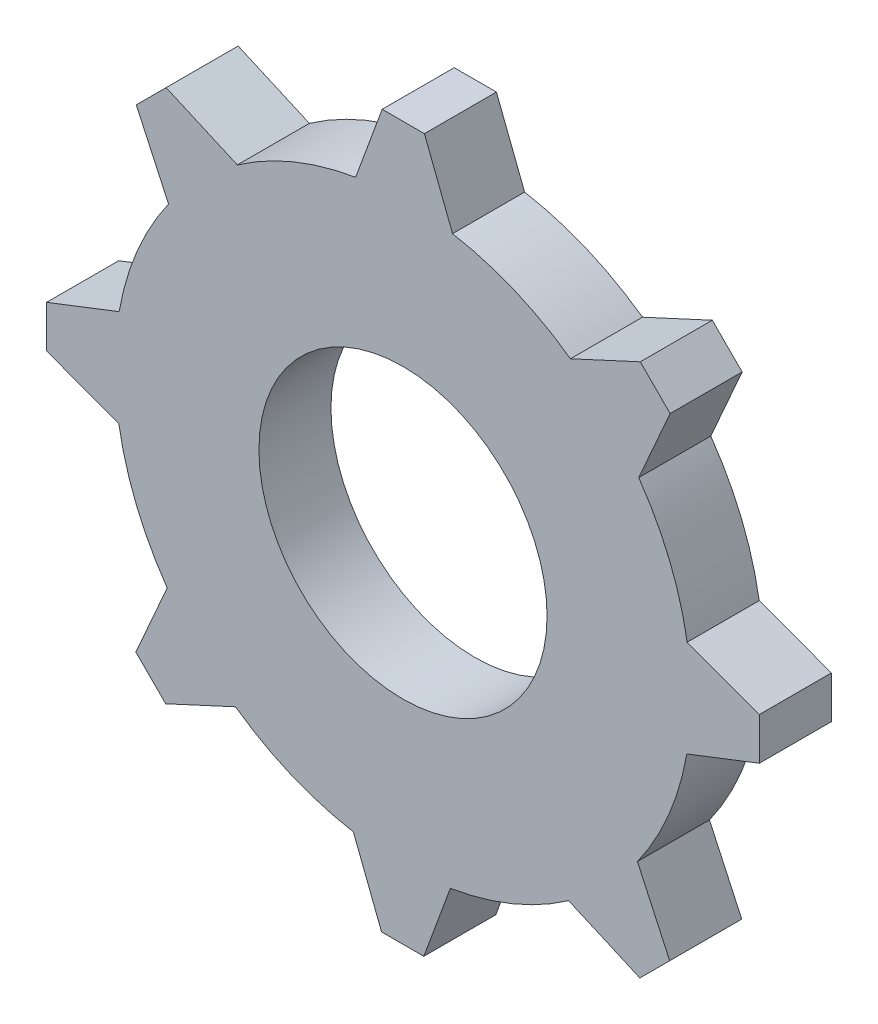
ISO-10303-21;
HEADER;
FILE_DESCRIPTION(('STEP AP214'),'2;1');
FILE_NAME('part.step','',(''),(''),'','','');
FILE_SCHEMA(('AUTOMOTIVE_DESIGN { 1 0 10303 214 1 1 1 1 }'));
ENDSEC;
DATA;
#1=APPLICATION_CONTEXT('core data for automotive mechanical design processes');
#2=APPLICATION_PROTOCOL_DEFINITION('international standard','automotive_design',2000,#1);
#3=PRODUCT_CONTEXT('',#1,'mechanical');
#4=PRODUCT('Part','Part','',(#3));
#5=PRODUCT_RELATED_PRODUCT_CATEGORY('part','',(#4));
#6=PRODUCT_DEFINITION_FORMATION('','',#4);
#7=PRODUCT_DEFINITION_CONTEXT('part definition',#1,'design');
#8=PRODUCT_DEFINITION('design','',#6,#7);
#9=PRODUCT_DEFINITION_SHAPE('','',#8);
#10=(LENGTH_UNIT() NAMED_UNIT(*) SI_UNIT(.MILLI.,.METRE.));
#11=(NAMED_UNIT(*) PLANE_ANGLE_UNIT() SI_UNIT($,.RADIAN.));
#12=(NAMED_UNIT(*) SI_UNIT($,.STERADIAN.) SOLID_ANGLE_UNIT());
#13=UNCERTAINTY_MEASURE_WITH_UNIT(LENGTH_MEASURE(1.E-05),#10,'distance_accuracy_value','');
#14=(GEOMETRIC_REPRESENTATION_CONTEXT(3) GLOBAL_UNCERTAINTY_ASSIGNED_CONTEXT((#13)) GLOBAL_UNIT_ASSIGNED_CONTEXT((#10,
#11,#12)) REPRESENTATION_CONTEXT('',''));
#15=CARTESIAN_POINT('',(0.,0.,0.));
#16=DIRECTION('',(0.,0.,1.));
#17=DIRECTION('',(1.,0.,0.));
#18=AXIS2_PLACEMENT_3D('',#15,#16,#17);
#19=CARTESIAN_POINT('',(0.,0.,2.));
#20=DIRECTION('',(0.,0.,-1.));
#21=DIRECTION('',(-1.,0.,0.));
#22=AXIS2_PLACEMENT_3D('',#19,#20,#21);
#23=CYLINDRICAL_SURFACE('',#22,8.);
#24=DIRECTION('',(0.,0.,-1.));
#25=VECTOR('',#24,1.);
#26=CARTESIAN_POINT('',(-6.50960676883214,4.65027092922281,2.));
#27=LINE('',#26,#25);
#28=CARTESIAN_POINT('',(-6.50960676883214,4.65027092922281,2.));
#29=VERTEX_POINT('',#28);
#30=CARTESIAN_POINT('',(-6.50960676883214,4.65027092922281,0.));
#31=VERTEX_POINT('',#30);
#32=EDGE_CURVE('E264',#29,#31,#27,.T.);
#33=ORIENTED_EDGE('',*,*,#32,.T.);
#34=CARTESIAN_POINT('',(0.,0.,0.));
#35=DIRECTION('',(0.,0.,1.));
#36=DIRECTION('',(1.,0.,0.));
#37=AXIS2_PLACEMENT_3D('',#34,#35,#36);
#38=CIRCLE('',#37,8.);
#39=CARTESIAN_POINT('',(-7.88063511388804,1.37680434403542,0.));
#40=VERTEX_POINT('',#39);
#41=EDGE_CURVE('E517',#31,#40,#38,.T.);
#42=ORIENTED_EDGE('',*,*,#41,.T.);
#43=DIRECTION('',(0.,0.,-1.));
#44=VECTOR('',#43,1.);
#45=CARTESIAN_POINT('',(-7.88063511388804,1.37680434403542,2.));
#46=LINE('',#45,#44);
#47=CARTESIAN_POINT('',(-7.88063511388804,1.37680434403542,2.));
#48=VERTEX_POINT('',#47);
#49=EDGE_CURVE('E296',#48,#40,#46,.T.);
#50=ORIENTED_EDGE('',*,*,#49,.F.);
#51=CARTESIAN_POINT('',(0.,0.,2.));
#52=DIRECTION('',(0.,0.,1.));
#53=DIRECTION('',(1.,0.,0.));
#54=AXIS2_PLACEMENT_3D('',#51,#52,#53);
#55=CIRCLE('',#54,8.);
#56=EDGE_CURVE('E42',#29,#48,#55,.T.);
#57=ORIENTED_EDGE('',*,*,#56,.F.);
#58=EDGE_LOOP('',(#33,#42,#50,#57));
#59=FACE_BOUND('',#58,.T.);
#60=ADVANCED_FACE('F33',(#59),#23,.T.);
#61=DIRECTION('',(0.,0.,-1.));
#62=VECTOR('',#61,1.);
#63=CARTESIAN_POINT('',(-4.5989028410525,6.54599821712161,2.));
#64=LINE('',#63,#62);
#65=CARTESIAN_POINT('',(-4.5989028410525,6.54599821712161,2.));
#66=VERTEX_POINT('',#65);
#67=CARTESIAN_POINT('',(-4.5989028410525,6.54599821712161,0.));
#68=VERTEX_POINT('',#67);
#69=EDGE_CURVE('E57',#66,#68,#64,.T.);
#70=ORIENTED_EDGE('',*,*,#69,.F.);
#71=CARTESIAN_POINT('',(-1.31474898069104,7.89122519750716,2.));
#72=VERTEX_POINT('',#71);
#73=EDGE_CURVE('E11',#72,#66,#55,.T.);
#74=ORIENTED_EDGE('',*,*,#73,.F.);
#75=DIRECTION('',(0.,0.,-1.));
#76=VECTOR('',#75,1.);
#77=CARTESIAN_POINT('',(-1.31474898069104,7.89122519750716,2.));
#78=LINE('',#77,#76);
#79=CARTESIAN_POINT('',(-1.31474898069104,7.89122519750716,0.));
#80=VERTEX_POINT('',#79);
#81=EDGE_CURVE('E461',#72,#80,#78,.T.);
#82=ORIENTED_EDGE('',*,*,#81,.T.);
#83=EDGE_CURVE('E37',#80,#68,#38,.T.);
#84=ORIENTED_EDGE('',*,*,#83,.T.);
#85=EDGE_LOOP('',(#70,#74,#82,#84));
#86=FACE_BOUND('',#85,.T.);
#87=ADVANCED_FACE('F492',(#86),#23,.T.);
#88=DIRECTION('',(0.,0.,-1.));
#89=VECTOR('',#88,1.);
#90=CARTESIAN_POINT('',(-7.89122519750717,-1.31474898069095,2.));
#91=LINE('',#90,#89);
#92=CARTESIAN_POINT('',(-7.89122519750717,-1.31474898069095,2.));
#93=VERTEX_POINT('',#92);
#94=CARTESIAN_POINT('',(-7.89122519750717,-1.31474898069095,0.));
#95=VERTEX_POINT('',#94);
#96=EDGE_CURVE('E299',#93,#95,#91,.T.);
#97=ORIENTED_EDGE('',*,*,#96,.T.);
#98=CARTESIAN_POINT('',(-6.54599821712159,-4.59890284105252,0.));
#99=VERTEX_POINT('',#98);
#100=EDGE_CURVE('E519',#95,#99,#38,.T.);
#101=ORIENTED_EDGE('',*,*,#100,.T.);
#102=DIRECTION('',(0.,0.,-1.));
#103=VECTOR('',#102,1.);
#104=CARTESIAN_POINT('',(-6.54599821712159,-4.59890284105252,2.));
#105=LINE('',#104,#103);
#106=CARTESIAN_POINT('',(-6.54599821712159,-4.59890284105252,2.));
#107=VERTEX_POINT('',#106);
#108=EDGE_CURVE('E323',#107,#99,#105,.T.);
#109=ORIENTED_EDGE('',*,*,#108,.F.);
#110=EDGE_CURVE('E551',#93,#107,#55,.T.);
#111=ORIENTED_EDGE('',*,*,#110,.F.);
#112=EDGE_LOOP('',(#97,#101,#109,#111));
#113=FACE_BOUND('',#112,.T.);
#114=ADVANCED_FACE('F496',(#113),#23,.T.);
#115=DIRECTION('',(0.,0.,-1.));
#116=VECTOR('',#115,1.);
#117=CARTESIAN_POINT('',(-4.65027092922279,-6.50960676883216,2.));
#118=LINE('',#117,#116);
#119=CARTESIAN_POINT('',(-4.65027092922279,-6.50960676883216,2.));
#120=VERTEX_POINT('',#119);
#121=CARTESIAN_POINT('',(-4.65027092922279,-6.50960676883216,0.));
#122=VERTEX_POINT('',#121);
#123=EDGE_CURVE('E326',#120,#122,#118,.T.);
#124=ORIENTED_EDGE('',*,*,#123,.T.);
#125=CARTESIAN_POINT('',(-1.37680434403534,-7.88063511388806,0.));
#126=VERTEX_POINT('',#125);
#127=EDGE_CURVE('E520',#122,#126,#38,.T.);
#128=ORIENTED_EDGE('',*,*,#127,.T.);
#129=DIRECTION('',(0.,0.,-1.));
#130=VECTOR('',#129,1.);
#131=CARTESIAN_POINT('',(-1.37680434403534,-7.88063511388806,2.));
#132=LINE('',#131,#130);
#133=CARTESIAN_POINT('',(-1.37680434403534,-7.88063511388806,2.));
#134=VERTEX_POINT('',#133);
#135=EDGE_CURVE('E350',#134,#126,#132,.T.);
#136=ORIENTED_EDGE('',*,*,#135,.F.);
#137=EDGE_CURVE('E550',#120,#134,#55,.T.);
#138=ORIENTED_EDGE('',*,*,#137,.F.);
#139=EDGE_LOOP('',(#124,#128,#136,#138));
#140=FACE_BOUND('',#139,.T.);
#141=ADVANCED_FACE('F580',(#140),#23,.T.);
#142=DIRECTION('',(0.,0.,-1.));
#143=VECTOR('',#142,1.);
#144=CARTESIAN_POINT('',(1.31474898069104,-7.89122519750716,2.));
#145=LINE('',#144,#143);
#146=CARTESIAN_POINT('',(1.31474898069104,-7.89122519750716,2.));
#147=VERTEX_POINT('',#146);
#148=CARTESIAN_POINT('',(1.31474898069104,-7.89122519750716,0.));
#149=VERTEX_POINT('',#148);
#150=EDGE_CURVE('E353',#147,#149,#145,.T.);
#151=ORIENTED_EDGE('',*,*,#150,.T.);
#152=CARTESIAN_POINT('',(4.59890284105254,-6.54599821712157,0.));
#153=VERTEX_POINT('',#152);
#154=EDGE_CURVE('E523',#149,#153,#38,.T.);
#155=ORIENTED_EDGE('',*,*,#154,.T.);
#156=DIRECTION('',(0.,0.,-1.));
#157=VECTOR('',#156,1.);
#158=CARTESIAN_POINT('',(4.59890284105254,-6.54599821712157,2.));
#159=LINE('',#158,#157);
#160=CARTESIAN_POINT('',(4.59890284105254,-6.54599821712157,2.));
#161=VERTEX_POINT('',#160);
#162=EDGE_CURVE('E377',#161,#153,#159,.T.);
#163=ORIENTED_EDGE('',*,*,#162,.F.);
#164=EDGE_CURVE('E549',#147,#161,#55,.T.);
#165=ORIENTED_EDGE('',*,*,#164,.F.);
#166=EDGE_LOOP('',(#151,#155,#163,#165));
#167=FACE_BOUND('',#166,.T.);
#168=ADVANCED_FACE('F595',(#167),#23,.T.);
#169=DIRECTION('',(0.,0.,-1.));
#170=VECTOR('',#169,1.);
#171=CARTESIAN_POINT('',(6.50960676883217,-4.65027092922277,2.));
#172=LINE('',#171,#170);
#173=CARTESIAN_POINT('',(6.50960676883217,-4.65027092922277,2.));
#174=VERTEX_POINT('',#173);
#175=CARTESIAN_POINT('',(6.50960676883217,-4.65027092922277,0.));
#176=VERTEX_POINT('',#175);
#177=EDGE_CURVE('E380',#174,#176,#172,.T.);
#178=ORIENTED_EDGE('',*,*,#177,.T.);
#179=CARTESIAN_POINT('',(7.88063511388805,-1.37680434403537,0.));
#180=VERTEX_POINT('',#179);
#181=EDGE_CURVE('E516',#176,#180,#38,.T.);
#182=ORIENTED_EDGE('',*,*,#181,.T.);
#183=DIRECTION('',(0.,0.,-1.));
#184=VECTOR('',#183,1.);
#185=CARTESIAN_POINT('',(7.88063511388805,-1.37680434403537,2.));
#186=LINE('',#185,#184);
#187=CARTESIAN_POINT('',(7.88063511388805,-1.37680434403537,2.));
#188=VERTEX_POINT('',#187);
#189=EDGE_CURVE('E404',#188,#180,#186,.T.);
#190=ORIENTED_EDGE('',*,*,#189,.F.);
#191=EDGE_CURVE('E547',#174,#188,#55,.T.);
#192=ORIENTED_EDGE('',*,*,#191,.F.);
#193=EDGE_LOOP('',(#178,#182,#190,#192));
#194=FACE_BOUND('',#193,.T.);
#195=ADVANCED_FACE('F504',(#194),#23,.T.);
#196=DIRECTION('',(0.,0.,-1.));
#197=VECTOR('',#196,1.);
#198=CARTESIAN_POINT('',(7.89122519750716,1.31474898069101,2.));
#199=LINE('',#198,#197);
#200=CARTESIAN_POINT('',(7.89122519750716,1.31474898069101,2.));
#201=VERTEX_POINT('',#200);
#202=CARTESIAN_POINT('',(7.89122519750716,1.31474898069101,0.));
#203=VERTEX_POINT('',#202);
#204=EDGE_CURVE('E407',#201,#203,#199,.T.);
#205=ORIENTED_EDGE('',*,*,#204,.T.);
#206=CARTESIAN_POINT('',(6.54599821712156,4.59890284105257,0.));
#207=VERTEX_POINT('',#206);
#208=EDGE_CURVE('E515',#203,#207,#38,.T.);
#209=ORIENTED_EDGE('',*,*,#208,.T.);
#210=DIRECTION('',(0.,0.,-1.));
#211=VECTOR('',#210,1.);
#212=CARTESIAN_POINT('',(6.54599821712156,4.59890284105257,2.));
#213=LINE('',#212,#211);
#214=CARTESIAN_POINT('',(6.54599821712156,4.59890284105257,2.));
#215=VERTEX_POINT('',#214);
#216=EDGE_CURVE('E431',#215,#207,#213,.T.);
#217=ORIENTED_EDGE('',*,*,#216,.F.);
#218=EDGE_CURVE('E518',#201,#215,#55,.T.);
#219=ORIENTED_EDGE('',*,*,#218,.F.);
#220=EDGE_LOOP('',(#205,#209,#217,#219));
#221=FACE_BOUND('',#220,.T.);
#222=ADVANCED_FACE('F498',(#221),#23,.T.);
#223=DIRECTION('',(0.,0.,-1.));
#224=VECTOR('',#223,1.);
#225=CARTESIAN_POINT('',(4.65027092922274,6.50960676883219,2.));
#226=LINE('',#225,#224);
#227=CARTESIAN_POINT('',(4.65027092922274,6.50960676883219,2.));
#228=VERTEX_POINT('',#227);
#229=CARTESIAN_POINT('',(4.65027092922274,6.50960676883219,0.));
#230=VERTEX_POINT('',#229);
#231=EDGE_CURVE('E434',#228,#230,#226,.T.);
#232=ORIENTED_EDGE('',*,*,#231,.T.);
#233=CARTESIAN_POINT('',(1.37680434403534,7.88063511388806,0.));
#234=VERTEX_POINT('',#233);
#235=EDGE_CURVE('E471',#230,#234,#38,.T.);
#236=ORIENTED_EDGE('',*,*,#235,.T.);
#237=DIRECTION('',(0.,0.,-1.));
#238=VECTOR('',#237,1.);
#239=CARTESIAN_POINT('',(1.37680434403534,7.88063511388806,2.));
#240=LINE('',#239,#238);
#241=CARTESIAN_POINT('',(1.37680434403534,7.88063511388806,2.));
#242=VERTEX_POINT('',#241);
#243=EDGE_CURVE('E458',#242,#234,#240,.T.);
#244=ORIENTED_EDGE('',*,*,#243,.F.);
#245=EDGE_CURVE('E43',#228,#242,#55,.T.);
#246=ORIENTED_EDGE('',*,*,#245,.F.);
#247=EDGE_LOOP('',(#232,#236,#244,#246));
#248=FACE_BOUND('',#247,.T.);
#249=ADVANCED_FACE('F35',(#248),#23,.T.);
#250=CARTESIAN_POINT('',(0.,0.,2.));
#251=DIRECTION('',(0.,0.,1.));
#252=DIRECTION('',(1.,0.,0.));
#253=AXIS2_PLACEMENT_3D('',#250,#251,#252);
#254=PLANE('',#253);
#255=ORIENTED_EDGE('',*,*,#73,.T.);
#256=DIRECTION('',(-0.915173590162917,0.403059920940195,0.));
#257=VECTOR('',#256,1.);
#258=CARTESIAN_POINT('',(-4.5989028410525,6.54599821712161,2.));
#259=LINE('',#258,#257);
#260=CARTESIAN_POINT('',(-6.57611749842603,7.41680129978148,2.));
#261=VERTEX_POINT('',#260);
#262=EDGE_CURVE('E250',#66,#261,#259,.T.);
#263=ORIENTED_EDGE('',*,*,#262,.T.);
#264=DIRECTION('',(-0.707106781186556,-0.707106781186539,0.));
#265=VECTOR('',#264,1.);
#266=CARTESIAN_POINT('',(-6.57611749842603,7.41680129978148,2.));
#267=LINE('',#266,#265);
#268=CARTESIAN_POINT('',(-7.40505215147342,6.58786664673412,2.));
#269=VERTEX_POINT('',#268);
#270=EDGE_CURVE('E242',#261,#269,#267,.T.);
#271=ORIENTED_EDGE('',*,*,#270,.T.);
#272=DIRECTION('',(0.41951017289391,-0.907750634722181,0.));
#273=VECTOR('',#272,1.);
#274=CARTESIAN_POINT('',(-7.40505215147342,6.58786664673412,2.));
#275=LINE('',#274,#273);
#276=EDGE_CURVE('E247',#269,#29,#275,.T.);
#277=ORIENTED_EDGE('',*,*,#276,.T.);
#278=ORIENTED_EDGE('',*,*,#56,.T.);
#279=DIRECTION('',(-0.932131854888362,-0.362119048245713,0.));
#280=VECTOR('',#279,1.);
#281=CARTESIAN_POINT('',(-7.88063511388804,1.37680434403542,2.));
#282=LINE('',#281,#280);
#283=CARTESIAN_POINT('',(-9.89448777080525,0.594453216772104,2.));
#284=VERTEX_POINT('',#283);
#285=EDGE_CURVE('E285',#48,#284,#282,.T.);
#286=ORIENTED_EDGE('',*,*,#285,.T.);
#287=DIRECTION('',(0.,-1.,0.));
#288=VECTOR('',#287,1.);
#289=CARTESIAN_POINT('',(-9.89448777080525,0.594453216772104,2.));
#290=LINE('',#289,#288);
#291=CARTESIAN_POINT('',(-9.89448777080526,-0.577837411888529,2.));
#292=VERTEX_POINT('',#291);
#293=EDGE_CURVE('E279',#284,#292,#290,.T.);
#294=ORIENTED_EDGE('',*,*,#293,.T.);
#295=DIRECTION('',(0.938515117468472,-0.34523814140842,0.));
#296=VECTOR('',#295,1.);
#297=CARTESIAN_POINT('',(-9.89448777080526,-0.577837411888529,2.));
#298=LINE('',#297,#296);
#299=EDGE_CURVE('E281',#292,#93,#298,.T.);
#300=ORIENTED_EDGE('',*,*,#299,.T.);
#301=ORIENTED_EDGE('',*,*,#110,.T.);
#302=DIRECTION('',(-0.403059920940192,-0.915173590162919,0.));
#303=VECTOR('',#302,1.);
#304=CARTESIAN_POINT('',(-6.54599821712159,-4.59890284105252,2.));
#305=LINE('',#304,#303);
#306=CARTESIAN_POINT('',(-7.41680129978146,-6.57611749842606,2.));
#307=VERTEX_POINT('',#306);
#308=EDGE_CURVE('E312',#107,#307,#305,.T.);
#309=ORIENTED_EDGE('',*,*,#308,.T.);
#310=DIRECTION('',(0.707106781186541,-0.707106781186554,0.));
#311=VECTOR('',#310,1.);
#312=CARTESIAN_POINT('',(-7.41680129978146,-6.57611749842606,2.));
#313=LINE('',#312,#311);
#314=CARTESIAN_POINT('',(-6.58786664673409,-7.40505215147344,2.));
#315=VERTEX_POINT('',#314);
#316=EDGE_CURVE('E306',#307,#315,#313,.T.);
#317=ORIENTED_EDGE('',*,*,#316,.T.);
#318=DIRECTION('',(0.907750634722179,0.419510172893913,0.));
#319=VECTOR('',#318,1.);
#320=CARTESIAN_POINT('',(-6.58786664673409,-7.40505215147344,2.));
#321=LINE('',#320,#319);
#322=EDGE_CURVE('E308',#315,#120,#321,.T.);
#323=ORIENTED_EDGE('',*,*,#322,.T.);
#324=ORIENTED_EDGE('',*,*,#137,.T.);
#325=DIRECTION('',(0.362119048245722,-0.932131854888358,0.));
#326=VECTOR('',#325,1.);
#327=CARTESIAN_POINT('',(-1.37680434403534,-7.88063511388806,2.));
#328=LINE('',#327,#326);
#329=CARTESIAN_POINT('',(-0.594453216772001,-9.89448777080526,2.));
#330=VERTEX_POINT('',#329);
#331=EDGE_CURVE('E339',#134,#330,#328,.T.);
#332=ORIENTED_EDGE('',*,*,#331,.T.);
#333=DIRECTION('',(1.,0.,0.));
#334=VECTOR('',#333,1.);
#335=CARTESIAN_POINT('',(-0.594453216772001,-9.89448777080526,2.));
#336=LINE('',#335,#334);
#337=CARTESIAN_POINT('',(0.577837411888633,-9.89448777080526,2.));
#338=VERTEX_POINT('',#337);
#339=EDGE_CURVE('E333',#330,#338,#336,.T.);
#340=ORIENTED_EDGE('',*,*,#339,.T.);
#341=DIRECTION('',(0.345238141408411,0.938515117468475,0.));
#342=VECTOR('',#341,1.);
#343=CARTESIAN_POINT('',(0.577837411888633,-9.89448777080526,2.));
#344=LINE('',#343,#342);
#345=EDGE_CURVE('E335',#338,#147,#344,.T.);
#346=ORIENTED_EDGE('',*,*,#345,.T.);
#347=ORIENTED_EDGE('',*,*,#164,.T.);
#348=DIRECTION('',(0.91517359016292,-0.403059920940189,0.));
#349=VECTOR('',#348,1.);
#350=CARTESIAN_POINT('',(4.59890284105254,-6.54599821712157,2.));
#351=LINE('',#350,#349);
#352=CARTESIAN_POINT('',(6.57611749842609,-7.41680129978144,2.));
#353=VERTEX_POINT('',#352);
#354=EDGE_CURVE('E366',#161,#353,#351,.T.);
#355=ORIENTED_EDGE('',*,*,#354,.T.);
#356=DIRECTION('',(0.707106781186551,0.707106781186544,0.));
#357=VECTOR('',#356,1.);
#358=CARTESIAN_POINT('',(6.57611749842609,-7.41680129978144,2.));
#359=LINE('',#358,#357);
#360=CARTESIAN_POINT('',(7.40505215147347,-6.58786664673407,2.));
#361=VERTEX_POINT('',#360);
#362=EDGE_CURVE('E360',#353,#361,#359,.T.);
#363=ORIENTED_EDGE('',*,*,#362,.T.);
#364=DIRECTION('',(-0.419510172893916,0.907750634722178,0.));
#365=VECTOR('',#364,1.);
#366=CARTESIAN_POINT('',(7.40505215147347,-6.58786664673407,2.));
#367=LINE('',#366,#365);
#368=EDGE_CURVE('E362',#361,#174,#367,.T.);
#369=ORIENTED_EDGE('',*,*,#368,.T.);
#370=ORIENTED_EDGE('',*,*,#191,.T.);
#371=DIRECTION('',(0.93213185488836,0.362119048245719,0.));
#372=VECTOR('',#371,1.);
#373=CARTESIAN_POINT('',(7.88063511388805,-1.37680434403537,2.));
#374=LINE('',#373,#372);
#375=CARTESIAN_POINT('',(9.89448777080526,-0.594453216772035,2.));
#376=VERTEX_POINT('',#375);
#377=EDGE_CURVE('E393',#188,#376,#374,.T.);
#378=ORIENTED_EDGE('',*,*,#377,.T.);
#379=DIRECTION('',(0.,1.,0.));
#380=VECTOR('',#379,1.);
#381=CARTESIAN_POINT('',(9.89448777080526,-0.594453216772035,2.));
#382=LINE('',#381,#380);
#383=CARTESIAN_POINT('',(9.89448777080526,0.577837411888598,2.));
#384=VERTEX_POINT('',#383);
#385=EDGE_CURVE('E387',#376,#384,#382,.T.);
#386=ORIENTED_EDGE('',*,*,#385,.T.);
#387=DIRECTION('',(-0.938515117468474,0.345238141408414,0.));
#388=VECTOR('',#387,1.);
#389=CARTESIAN_POINT('',(9.89448777080526,0.577837411888598,2.));
#390=LINE('',#389,#388);
#391=EDGE_CURVE('E389',#384,#201,#390,.T.);
#392=ORIENTED_EDGE('',*,*,#391,.T.);
#393=ORIENTED_EDGE('',*,*,#218,.T.);
#394=DIRECTION('',(0.403059920940186,0.915173590162921,0.));
#395=VECTOR('',#394,1.);
#396=CARTESIAN_POINT('',(6.54599821712156,4.59890284105257,2.));
#397=LINE('',#396,#395);
#398=CARTESIAN_POINT('',(7.41680129978141,6.57611749842611,2.));
#399=VERTEX_POINT('',#398);
#400=EDGE_CURVE('E420',#215,#399,#397,.T.);
#401=ORIENTED_EDGE('',*,*,#400,.T.);
#402=DIRECTION('',(-0.707106781186546,0.707106781186549,0.));
#403=VECTOR('',#402,1.);
#404=CARTESIAN_POINT('',(7.41680129978141,6.57611749842611,2.));
#405=LINE('',#404,#403);
#406=CARTESIAN_POINT('',(6.58786664673404,7.40505215147349,2.));
#407=VERTEX_POINT('',#406);
#408=EDGE_CURVE('E414',#399,#407,#405,.T.);
#409=ORIENTED_EDGE('',*,*,#408,.T.);
#410=DIRECTION('',(-0.907750634722176,-0.419510172893919,0.));
#411=VECTOR('',#410,1.);
#412=CARTESIAN_POINT('',(6.58786664673404,7.40505215147349,2.));
#413=LINE('',#412,#411);
#414=EDGE_CURVE('E416',#407,#228,#413,.T.);
#415=ORIENTED_EDGE('',*,*,#414,.T.);
#416=ORIENTED_EDGE('',*,*,#245,.T.);
#417=DIRECTION('',(-0.362119048245722,0.932131854888358,0.));
#418=VECTOR('',#417,1.);
#419=CARTESIAN_POINT('',(1.37680434403534,7.88063511388806,2.));
#420=LINE('',#419,#418);
#421=CARTESIAN_POINT('',(0.594453216772001,9.89448777080526,2.));
#422=VERTEX_POINT('',#421);
#423=EDGE_CURVE('E447',#242,#422,#420,.T.);
#424=ORIENTED_EDGE('',*,*,#423,.T.);
#425=DIRECTION('',(-1.,0.,0.));
#426=VECTOR('',#425,1.);
#427=CARTESIAN_POINT('',(0.594453216772001,9.89448777080526,2.));
#428=LINE('',#427,#426);
#429=CARTESIAN_POINT('',(-0.577837411888633,9.89448777080526,2.));
#430=VERTEX_POINT('',#429);
#431=EDGE_CURVE('E441',#422,#430,#428,.T.);
#432=ORIENTED_EDGE('',*,*,#431,.T.);
#433=DIRECTION('',(-0.345238141408411,-0.938515117468475,0.));
#434=VECTOR('',#433,1.);
#435=CARTESIAN_POINT('',(-0.577837411888633,9.89448777080526,2.));
#436=LINE('',#435,#434);
#437=EDGE_CURVE('E443',#430,#72,#436,.T.);
#438=ORIENTED_EDGE('',*,*,#437,.T.);
#439=EDGE_LOOP('',(#255,#263,#271,#277,#278,#286,#294,#300,#301,#309,#317,#323,#324,#332,#340,
#346,#347,#355,#363,#369,#370,#378,#386,#392,#393,#401,#409,#415,#416,#424,#432,#438));
#440=FACE_BOUND('',#439,.T.);
#441=CARTESIAN_POINT('',(0.,0.,2.));
#442=DIRECTION('',(0.,0.,1.));
#443=DIRECTION('',(1.,0.,0.));
#444=AXIS2_PLACEMENT_3D('',#441,#442,#443);
#445=CIRCLE('',#444,4.);
#446=CARTESIAN_POINT('',(4.,0.,2.));
#447=VERTEX_POINT('',#446);
#448=EDGE_CURVE('E468',#447,#447,#445,.T.);
#449=ORIENTED_EDGE('',*,*,#448,.F.);
#450=EDGE_LOOP('',(#449));
#451=FACE_BOUND('',#450,.T.);
#452=ADVANCED_FACE('F244',(#440,#451),#254,.T.);
#453=CARTESIAN_POINT('',(0.,0.,0.));
#454=DIRECTION('',(0.,0.,1.));
#455=DIRECTION('',(1.,0.,0.));
#456=AXIS2_PLACEMENT_3D('',#453,#454,#455);
#457=PLANE('',#456);
#458=ORIENTED_EDGE('',*,*,#41,.F.);
#459=DIRECTION('',(0.41951017289391,-0.907750634722181,0.));
#460=VECTOR('',#459,1.);
#461=CARTESIAN_POINT('',(-7.40505215147342,6.58786664673412,0.));
#462=LINE('',#461,#460);
#463=CARTESIAN_POINT('',(-7.40505215147342,6.58786664673412,0.));
#464=VERTEX_POINT('',#463);
#465=EDGE_CURVE('E272',#464,#31,#462,.T.);
#466=ORIENTED_EDGE('',*,*,#465,.F.);
#467=DIRECTION('',(-0.707106781186556,-0.707106781186539,0.));
#468=VECTOR('',#467,1.);
#469=CARTESIAN_POINT('',(-6.98987857045055,7.00304022775697,0.));
#470=LINE('',#469,#468);
#471=CARTESIAN_POINT('',(-6.57611749842603,7.41680129978148,0.));
#472=VERTEX_POINT('',#471);
#473=EDGE_CURVE('E259',#472,#464,#470,.T.);
#474=ORIENTED_EDGE('',*,*,#473,.F.);
#475=DIRECTION('',(-0.915173590162917,0.403059920940195,0.));
#476=VECTOR('',#475,1.);
#477=CARTESIAN_POINT('',(-4.5989028410525,6.54599821712161,0.));
#478=LINE('',#477,#476);
#479=EDGE_CURVE('E254',#68,#472,#478,.T.);
#480=ORIENTED_EDGE('',*,*,#479,.F.);
#481=ORIENTED_EDGE('',*,*,#83,.F.);
#482=DIRECTION('',(-0.345238141408411,-0.938515117468475,0.));
#483=VECTOR('',#482,1.);
#484=CARTESIAN_POINT('',(-0.577837411888633,9.89448777080526,0.));
#485=LINE('',#484,#483);
#486=CARTESIAN_POINT('',(-0.577837411888633,9.89448777080526,0.));
#487=VERTEX_POINT('',#486);
#488=EDGE_CURVE('E451',#487,#80,#485,.T.);
#489=ORIENTED_EDGE('',*,*,#488,.F.);
#490=DIRECTION('',(-1.,0.,0.));
#491=VECTOR('',#490,1.);
#492=CARTESIAN_POINT('',(0.00930669713290157,9.89448777080526,0.));
#493=LINE('',#492,#491);
#494=CARTESIAN_POINT('',(0.594453216772001,9.89448777080526,0.));
#495=VERTEX_POINT('',#494);
#496=EDGE_CURVE('E440',#495,#487,#493,.T.);
#497=ORIENTED_EDGE('',*,*,#496,.F.);
#498=DIRECTION('',(-0.362119048245722,0.932131854888358,0.));
#499=VECTOR('',#498,1.);
#500=CARTESIAN_POINT('',(1.37680434403534,7.88063511388806,0.));
#501=LINE('',#500,#499);
#502=EDGE_CURVE('E444',#234,#495,#501,.T.);
#503=ORIENTED_EDGE('',*,*,#502,.F.);
#504=ORIENTED_EDGE('',*,*,#235,.F.);
#505=DIRECTION('',(-0.907750634722176,-0.419510172893919,0.));
#506=VECTOR('',#505,1.);
#507=CARTESIAN_POINT('',(6.58786664673404,7.40505215147349,0.));
#508=LINE('',#507,#506);
#509=CARTESIAN_POINT('',(6.58786664673404,7.40505215147349,0.));
#510=VERTEX_POINT('',#509);
#511=EDGE_CURVE('E424',#510,#230,#508,.T.);
#512=ORIENTED_EDGE('',*,*,#511,.F.);
#513=DIRECTION('',(-0.707106781186546,0.707106781186549,0.));
#514=VECTOR('',#513,1.);
#515=CARTESIAN_POINT('',(7.0030402277569,6.98987857045063,0.));
#516=LINE('',#515,#514);
#517=CARTESIAN_POINT('',(7.41680129978141,6.57611749842611,0.));
#518=VERTEX_POINT('',#517);
#519=EDGE_CURVE('E413',#518,#510,#516,.T.);
#520=ORIENTED_EDGE('',*,*,#519,.F.);
#521=DIRECTION('',(0.403059920940186,0.915173590162921,0.));
#522=VECTOR('',#521,1.);
#523=CARTESIAN_POINT('',(6.54599821712156,4.59890284105257,0.));
#524=LINE('',#523,#522);
#525=EDGE_CURVE('E417',#207,#518,#524,.T.);
#526=ORIENTED_EDGE('',*,*,#525,.F.);
#527=ORIENTED_EDGE('',*,*,#208,.F.);
#528=DIRECTION('',(-0.938515117468474,0.345238141408414,0.));
#529=VECTOR('',#528,1.);
#530=CARTESIAN_POINT('',(9.89448777080526,0.577837411888598,0.));
#531=LINE('',#530,#529);
#532=CARTESIAN_POINT('',(9.89448777080526,0.577837411888598,0.));
#533=VERTEX_POINT('',#532);
#534=EDGE_CURVE('E397',#533,#203,#531,.T.);
#535=ORIENTED_EDGE('',*,*,#534,.F.);
#536=DIRECTION('',(0.,1.,0.));
#537=VECTOR('',#536,1.);
#538=CARTESIAN_POINT('',(9.89448777080526,-0.00930669713293612,0.));
#539=LINE('',#538,#537);
#540=CARTESIAN_POINT('',(9.89448777080526,-0.594453216772035,0.));
#541=VERTEX_POINT('',#540);
#542=EDGE_CURVE('E386',#541,#533,#539,.T.);
#543=ORIENTED_EDGE('',*,*,#542,.F.);
#544=DIRECTION('',(0.93213185488836,0.362119048245719,0.));
#545=VECTOR('',#544,1.);
#546=CARTESIAN_POINT('',(7.88063511388805,-1.37680434403537,0.));
#547=LINE('',#546,#545);
#548=EDGE_CURVE('E390',#180,#541,#547,.T.);
#549=ORIENTED_EDGE('',*,*,#548,.F.);
#550=ORIENTED_EDGE('',*,*,#181,.F.);
#551=DIRECTION('',(-0.419510172893916,0.907750634722178,0.));
#552=VECTOR('',#551,1.);
#553=CARTESIAN_POINT('',(7.40505215147347,-6.58786664673407,0.));
#554=LINE('',#553,#552);
#555=CARTESIAN_POINT('',(7.40505215147347,-6.58786664673407,0.));
#556=VERTEX_POINT('',#555);
#557=EDGE_CURVE('E370',#556,#176,#554,.T.);
#558=ORIENTED_EDGE('',*,*,#557,.F.);
#559=DIRECTION('',(0.707106781186551,0.707106781186544,0.));
#560=VECTOR('',#559,1.);
#561=CARTESIAN_POINT('',(6.9898785704506,-7.00304022775692,0.));
#562=LINE('',#561,#560);
#563=CARTESIAN_POINT('',(6.57611749842609,-7.41680129978144,0.));
#564=VERTEX_POINT('',#563);
#565=EDGE_CURVE('E359',#564,#556,#562,.T.);
#566=ORIENTED_EDGE('',*,*,#565,.F.);
#567=DIRECTION('',(0.91517359016292,-0.403059920940189,0.));
#568=VECTOR('',#567,1.);
#569=CARTESIAN_POINT('',(4.59890284105254,-6.54599821712157,0.));
#570=LINE('',#569,#568);
#571=EDGE_CURVE('E363',#153,#564,#570,.T.);
#572=ORIENTED_EDGE('',*,*,#571,.F.);
#573=ORIENTED_EDGE('',*,*,#154,.F.);
#574=DIRECTION('',(0.345238141408411,0.938515117468475,0.));
#575=VECTOR('',#574,1.);
#576=CARTESIAN_POINT('',(0.577837411888633,-9.89448777080526,0.));
#577=LINE('',#576,#575);
#578=CARTESIAN_POINT('',(0.577837411888633,-9.89448777080526,0.));
#579=VERTEX_POINT('',#578);
#580=EDGE_CURVE('E343',#579,#149,#577,.T.);
#581=ORIENTED_EDGE('',*,*,#580,.F.);
#582=DIRECTION('',(1.,0.,0.));
#583=VECTOR('',#582,1.);
#584=CARTESIAN_POINT('',(-0.00930669713290157,-9.89448777080526,0.));
#585=LINE('',#584,#583);
#586=CARTESIAN_POINT('',(-0.594453216772001,-9.89448777080526,0.));
#587=VERTEX_POINT('',#586);
#588=EDGE_CURVE('E332',#587,#579,#585,.T.);
#589=ORIENTED_EDGE('',*,*,#588,.F.);
#590=DIRECTION('',(0.362119048245722,-0.932131854888358,0.));
#591=VECTOR('',#590,1.);
#592=CARTESIAN_POINT('',(-1.37680434403534,-7.88063511388806,0.));
#593=LINE('',#592,#591);
#594=EDGE_CURVE('E336',#126,#587,#593,.T.);
#595=ORIENTED_EDGE('',*,*,#594,.F.);
#596=ORIENTED_EDGE('',*,*,#127,.F.);
#597=DIRECTION('',(0.907750634722179,0.419510172893913,0.));
#598=VECTOR('',#597,1.);
#599=CARTESIAN_POINT('',(-6.58786664673409,-7.40505215147344,0.));
#600=LINE('',#599,#598);
#601=CARTESIAN_POINT('',(-6.58786664673409,-7.40505215147344,0.));
#602=VERTEX_POINT('',#601);
#603=EDGE_CURVE('E316',#602,#122,#600,.T.);
#604=ORIENTED_EDGE('',*,*,#603,.F.);
#605=DIRECTION('',(0.707106781186541,-0.707106781186554,0.));
#606=VECTOR('',#605,1.);
#607=CARTESIAN_POINT('',(-7.00304022775695,-6.98987857045058,0.));
#608=LINE('',#607,#606);
#609=CARTESIAN_POINT('',(-7.41680129978146,-6.57611749842606,0.));
#610=VERTEX_POINT('',#609);
#611=EDGE_CURVE('E305',#610,#602,#608,.T.);
#612=ORIENTED_EDGE('',*,*,#611,.F.);
#613=DIRECTION('',(-0.403059920940192,-0.915173590162919,0.));
#614=VECTOR('',#613,1.);
#615=CARTESIAN_POINT('',(-6.54599821712159,-4.59890284105252,0.));
#616=LINE('',#615,#614);
#617=EDGE_CURVE('E309',#99,#610,#616,.T.);
#618=ORIENTED_EDGE('',*,*,#617,.F.);
#619=ORIENTED_EDGE('',*,*,#100,.F.);
#620=DIRECTION('',(0.938515117468472,-0.34523814140842,0.));
#621=VECTOR('',#620,1.);
#622=CARTESIAN_POINT('',(-9.89448777080526,-0.577837411888529,0.));
#623=LINE('',#622,#621);
#624=CARTESIAN_POINT('',(-9.89448777080526,-0.577837411888529,0.));
#625=VERTEX_POINT('',#624);
#626=EDGE_CURVE('E289',#625,#95,#623,.T.);
#627=ORIENTED_EDGE('',*,*,#626,.F.);
#628=DIRECTION('',(0.,-1.,0.));
#629=VECTOR('',#628,1.);
#630=CARTESIAN_POINT('',(-9.89448777080526,0.00930669713300521,0.));
#631=LINE('',#630,#629);
#632=CARTESIAN_POINT('',(-9.89448777080525,0.594453216772104,0.));
#633=VERTEX_POINT('',#632);
#634=EDGE_CURVE('E263',#633,#625,#631,.T.);
#635=ORIENTED_EDGE('',*,*,#634,.F.);
#636=DIRECTION('',(-0.932131854888362,-0.362119048245713,0.));
#637=VECTOR('',#636,1.);
#638=CARTESIAN_POINT('',(-7.88063511388804,1.37680434403542,0.));
#639=LINE('',#638,#637);
#640=EDGE_CURVE('E282',#40,#633,#639,.T.);
#641=ORIENTED_EDGE('',*,*,#640,.F.);
#642=EDGE_LOOP('',(#458,#466,#474,#480,#481,#489,#497,#503,#504,#512,#520,#526,#527,#535,#543,
#549,#550,#558,#566,#572,#573,#581,#589,#595,#596,#604,#612,#618,#619,#627,#635,#641));
#643=FACE_BOUND('',#642,.T.);
#644=CARTESIAN_POINT('',(0.,0.,0.));
#645=DIRECTION('',(0.,0.,1.));
#646=DIRECTION('',(1.,0.,0.));
#647=AXIS2_PLACEMENT_3D('',#644,#645,#646);
#648=CIRCLE('',#647,4.);
#649=CARTESIAN_POINT('',(4.,0.,0.));
#650=VERTEX_POINT('',#649);
#651=EDGE_CURVE('E467',#650,#650,#648,.T.);
#652=ORIENTED_EDGE('',*,*,#651,.T.);
#653=EDGE_LOOP('',(#652));
#654=FACE_BOUND('',#653,.T.);
#655=ADVANCED_FACE('F475',(#643,#654),#457,.F.);
#656=CARTESIAN_POINT('',(0.,0.,2.));
#657=DIRECTION('',(0.,0.,-1.));
#658=DIRECTION('',(-1.,0.,0.));
#659=AXIS2_PLACEMENT_3D('',#656,#657,#658);
#660=CYLINDRICAL_SURFACE('',#659,4.);
#661=ORIENTED_EDGE('',*,*,#448,.T.);
#662=EDGE_LOOP('',(#661));
#663=FACE_BOUND('',#662,.T.);
#664=ORIENTED_EDGE('',*,*,#651,.F.);
#665=EDGE_LOOP('',(#664));
#666=FACE_BOUND('',#665,.T.);
#667=ADVANCED_FACE('F477',(#663,#666),#660,.F.);
#668=CARTESIAN_POINT('',(0.00930669713290157,9.89448777080526,2.));
#669=DIRECTION('',(0.,-1.,0.));
#670=DIRECTION('',(0.,0.,-1.));
#671=AXIS2_PLACEMENT_3D('',#668,#669,#670);
#672=PLANE('',#671);
#673=ORIENTED_EDGE('',*,*,#496,.T.);
#674=DIRECTION('',(0.,0.,-1.));
#675=VECTOR('',#674,1.);
#676=CARTESIAN_POINT('',(-0.577837411888633,9.89448777080526,2.));
#677=LINE('',#676,#675);
#678=EDGE_CURVE('E464',#430,#487,#677,.T.);
#679=ORIENTED_EDGE('',*,*,#678,.F.);
#680=ORIENTED_EDGE('',*,*,#431,.F.);
#681=DIRECTION('',(0.,0.,-1.));
#682=VECTOR('',#681,1.);
#683=CARTESIAN_POINT('',(0.594453216772001,9.89448777080526,2.));
#684=LINE('',#683,#682);
#685=EDGE_CURVE('E449',#422,#495,#684,.T.);
#686=ORIENTED_EDGE('',*,*,#685,.T.);
#687=EDGE_LOOP('',(#673,#679,#680,#686));
#688=FACE_BOUND('',#687,.T.);
#689=ADVANCED_FACE('F479',(#688),#672,.F.);
#690=CARTESIAN_POINT('',(-0.577837411888633,9.89448777080526,2.));
#691=DIRECTION('',(0.938515117468475,-0.345238141408411,0.));
#692=DIRECTION('',(0.345238141408411,0.938515117468475,0.));
#693=AXIS2_PLACEMENT_3D('',#690,#691,#692);
#694=PLANE('',#693);
#695=ORIENTED_EDGE('',*,*,#488,.T.);
#696=ORIENTED_EDGE('',*,*,#81,.F.);
#697=ORIENTED_EDGE('',*,*,#437,.F.);
#698=ORIENTED_EDGE('',*,*,#678,.T.);
#699=EDGE_LOOP('',(#695,#696,#697,#698));
#700=FACE_BOUND('',#699,.T.);
#701=ADVANCED_FACE('F486',(#700),#694,.F.);
#702=CARTESIAN_POINT('',(1.37680434403534,7.88063511388806,2.));
#703=DIRECTION('',(-0.932131854888359,-0.362119048245722,0.));
#704=DIRECTION('',(0.362119048245722,-0.932131854888359,0.));
#705=AXIS2_PLACEMENT_3D('',#702,#703,#704);
#706=PLANE('',#705);
#707=ORIENTED_EDGE('',*,*,#502,.T.);
#708=ORIENTED_EDGE('',*,*,#685,.F.);
#709=ORIENTED_EDGE('',*,*,#423,.F.);
#710=ORIENTED_EDGE('',*,*,#243,.T.);
#711=EDGE_LOOP('',(#707,#708,#709,#710));
#712=FACE_BOUND('',#711,.T.);
#713=ADVANCED_FACE('F658',(#712),#706,.F.);
#714=CARTESIAN_POINT('',(7.0030402277569,6.98987857045063,2.));
#715=DIRECTION('',(-0.707106781186549,-0.707106781186546,0.));
#716=DIRECTION('',(0.707106781186546,-0.707106781186549,0.));
#717=AXIS2_PLACEMENT_3D('',#714,#715,#716);
#718=PLANE('',#717);
#719=ORIENTED_EDGE('',*,*,#519,.T.);
#720=DIRECTION('',(0.,0.,-1.));
#721=VECTOR('',#720,1.);
#722=CARTESIAN_POINT('',(6.58786664673404,7.40505215147349,2.));
#723=LINE('',#722,#721);
#724=EDGE_CURVE('E437',#407,#510,#723,.T.);
#725=ORIENTED_EDGE('',*,*,#724,.F.);
#726=ORIENTED_EDGE('',*,*,#408,.F.);
#727=DIRECTION('',(0.,0.,-1.));
#728=VECTOR('',#727,1.);
#729=CARTESIAN_POINT('',(7.41680129978141,6.57611749842611,2.));
#730=LINE('',#729,#728);
#731=EDGE_CURVE('E422',#399,#518,#730,.T.);
#732=ORIENTED_EDGE('',*,*,#731,.T.);
#733=EDGE_LOOP('',(#719,#725,#726,#732));
#734=FACE_BOUND('',#733,.T.);
#735=ADVANCED_FACE('F655',(#734),#718,.F.);
#736=CARTESIAN_POINT('',(6.58786664673404,7.40505215147349,2.));
#737=DIRECTION('',(0.419510172893919,-0.907750634722176,0.));
#738=DIRECTION('',(0.907750634722176,0.419510172893919,0.));
#739=AXIS2_PLACEMENT_3D('',#736,#737,#738);
#740=PLANE('',#739);
#741=ORIENTED_EDGE('',*,*,#511,.T.);
#742=ORIENTED_EDGE('',*,*,#231,.F.);
#743=ORIENTED_EDGE('',*,*,#414,.F.);
#744=ORIENTED_EDGE('',*,*,#724,.T.);
#745=EDGE_LOOP('',(#741,#742,#743,#744));
#746=FACE_BOUND('',#745,.T.);
#747=ADVANCED_FACE('F511',(#746),#740,.F.);
#748=CARTESIAN_POINT('',(6.54599821712156,4.59890284105257,2.));
#749=DIRECTION('',(-0.915173590162922,0.403059920940186,0.));
#750=DIRECTION('',(-0.403059920940186,-0.915173590162922,0.));
#751=AXIS2_PLACEMENT_3D('',#748,#749,#750);
#752=PLANE('',#751);
#753=ORIENTED_EDGE('',*,*,#525,.T.);
#754=ORIENTED_EDGE('',*,*,#731,.F.);
#755=ORIENTED_EDGE('',*,*,#400,.F.);
#756=ORIENTED_EDGE('',*,*,#216,.T.);
#757=EDGE_LOOP('',(#753,#754,#755,#756));
#758=FACE_BOUND('',#757,.T.);
#759=ADVANCED_FACE('F649',(#758),#752,.F.);
#760=CARTESIAN_POINT('',(9.89448777080526,-0.00930669713293612,2.));
#761=DIRECTION('',(-1.,0.,0.));
#762=DIRECTION('',(0.,-1.,0.));
#763=AXIS2_PLACEMENT_3D('',#760,#761,#762);
#764=PLANE('',#763);
#765=ORIENTED_EDGE('',*,*,#542,.T.);
#766=DIRECTION('',(0.,0.,-1.));
#767=VECTOR('',#766,1.);
#768=CARTESIAN_POINT('',(9.89448777080526,0.577837411888598,2.));
#769=LINE('',#768,#767);
#770=EDGE_CURVE('E410',#384,#533,#769,.T.);
#771=ORIENTED_EDGE('',*,*,#770,.F.);
#772=ORIENTED_EDGE('',*,*,#385,.F.);
#773=DIRECTION('',(0.,0.,-1.));
#774=VECTOR('',#773,1.);
#775=CARTESIAN_POINT('',(9.89448777080526,-0.594453216772035,2.));
#776=LINE('',#775,#774);
#777=EDGE_CURVE('E395',#376,#541,#776,.T.);
#778=ORIENTED_EDGE('',*,*,#777,.T.);
#779=EDGE_LOOP('',(#765,#771,#772,#778));
#780=FACE_BOUND('',#779,.T.);
#781=ADVANCED_FACE('F540',(#780),#764,.F.);
#782=CARTESIAN_POINT('',(9.89448777080526,0.577837411888598,2.));
#783=DIRECTION('',(-0.345238141408414,-0.938515117468474,0.));
#784=DIRECTION('',(0.938515117468474,-0.345238141408414,0.));
#785=AXIS2_PLACEMENT_3D('',#782,#783,#784);
#786=PLANE('',#785);
#787=ORIENTED_EDGE('',*,*,#534,.T.);
#788=ORIENTED_EDGE('',*,*,#204,.F.);
#789=ORIENTED_EDGE('',*,*,#391,.F.);
#790=ORIENTED_EDGE('',*,*,#770,.T.);
#791=EDGE_LOOP('',(#787,#788,#789,#790));
#792=FACE_BOUND('',#791,.T.);
#793=ADVANCED_FACE('F544',(#792),#786,.F.);
#794=CARTESIAN_POINT('',(7.88063511388805,-1.37680434403537,2.));
#795=DIRECTION('',(-0.362119048245719,0.93213185488836,0.));
#796=DIRECTION('',(-0.93213185488836,-0.362119048245719,0.));
#797=AXIS2_PLACEMENT_3D('',#794,#795,#796);
#798=PLANE('',#797);
#799=ORIENTED_EDGE('',*,*,#548,.T.);
#800=ORIENTED_EDGE('',*,*,#777,.F.);
#801=ORIENTED_EDGE('',*,*,#377,.F.);
#802=ORIENTED_EDGE('',*,*,#189,.T.);
#803=EDGE_LOOP('',(#799,#800,#801,#802));
#804=FACE_BOUND('',#803,.T.);
#805=ADVANCED_FACE('F535',(#804),#798,.F.);
#806=CARTESIAN_POINT('',(6.9898785704506,-7.00304022775692,2.));
#807=DIRECTION('',(-0.707106781186544,0.707106781186551,0.));
#808=DIRECTION('',(-0.707106781186551,-0.707106781186544,0.));
#809=AXIS2_PLACEMENT_3D('',#806,#807,#808);
#810=PLANE('',#809);
#811=ORIENTED_EDGE('',*,*,#565,.T.);
#812=DIRECTION('',(0.,0.,-1.));
#813=VECTOR('',#812,1.);
#814=CARTESIAN_POINT('',(7.40505215147347,-6.58786664673407,2.));
#815=LINE('',#814,#813);
#816=EDGE_CURVE('E383',#361,#556,#815,.T.);
#817=ORIENTED_EDGE('',*,*,#816,.F.);
#818=ORIENTED_EDGE('',*,*,#362,.F.);
#819=DIRECTION('',(0.,0.,-1.));
#820=VECTOR('',#819,1.);
#821=CARTESIAN_POINT('',(6.57611749842609,-7.41680129978144,2.));
#822=LINE('',#821,#820);
#823=EDGE_CURVE('E368',#353,#564,#822,.T.);
#824=ORIENTED_EDGE('',*,*,#823,.T.);
#825=EDGE_LOOP('',(#811,#817,#818,#824));
#826=FACE_BOUND('',#825,.T.);
#827=ADVANCED_FACE('F604',(#826),#810,.F.);
#828=CARTESIAN_POINT('',(7.40505215147347,-6.58786664673407,2.));
#829=DIRECTION('',(-0.907750634722178,-0.419510172893916,0.));
#830=DIRECTION('',(0.419510172893916,-0.907750634722178,0.));
#831=AXIS2_PLACEMENT_3D('',#828,#829,#830);
#832=PLANE('',#831);
#833=ORIENTED_EDGE('',*,*,#557,.T.);
#834=ORIENTED_EDGE('',*,*,#177,.F.);
#835=ORIENTED_EDGE('',*,*,#368,.F.);
#836=ORIENTED_EDGE('',*,*,#816,.T.);
#837=EDGE_LOOP('',(#833,#834,#835,#836));
#838=FACE_BOUND('',#837,.T.);
#839=ADVANCED_FACE('F606',(#838),#832,.F.);
#840=CARTESIAN_POINT('',(4.59890284105254,-6.54599821712157,2.));
#841=DIRECTION('',(0.403059920940189,0.91517359016292,0.));
#842=DIRECTION('',(-0.91517359016292,0.403059920940189,0.));
#843=AXIS2_PLACEMENT_3D('',#840,#841,#842);
#844=PLANE('',#843);
#845=ORIENTED_EDGE('',*,*,#571,.T.);
#846=ORIENTED_EDGE('',*,*,#823,.F.);
#847=ORIENTED_EDGE('',*,*,#354,.F.);
#848=ORIENTED_EDGE('',*,*,#162,.T.);
#849=EDGE_LOOP('',(#845,#846,#847,#848));
#850=FACE_BOUND('',#849,.T.);
#851=ADVANCED_FACE('F600',(#850),#844,.F.);
#852=CARTESIAN_POINT('',(-0.00930669713290157,-9.89448777080526,2.));
#853=DIRECTION('',(0.,1.,0.));
#854=DIRECTION('',(0.,0.,1.));
#855=AXIS2_PLACEMENT_3D('',#852,#853,#854);
#856=PLANE('',#855);
#857=ORIENTED_EDGE('',*,*,#588,.T.);
#858=DIRECTION('',(0.,0.,-1.));
#859=VECTOR('',#858,1.);
#860=CARTESIAN_POINT('',(0.577837411888633,-9.89448777080526,2.));
#861=LINE('',#860,#859);
#862=EDGE_CURVE('E356',#338,#579,#861,.T.);
#863=ORIENTED_EDGE('',*,*,#862,.F.);
#864=ORIENTED_EDGE('',*,*,#339,.F.);
#865=DIRECTION('',(0.,0.,-1.));
#866=VECTOR('',#865,1.);
#867=CARTESIAN_POINT('',(-0.594453216772001,-9.89448777080526,2.));
#868=LINE('',#867,#866);
#869=EDGE_CURVE('E341',#330,#587,#868,.T.);
#870=ORIENTED_EDGE('',*,*,#869,.T.);
#871=EDGE_LOOP('',(#857,#863,#864,#870));
#872=FACE_BOUND('',#871,.T.);
#873=ADVANCED_FACE('F591',(#872),#856,.F.);
#874=CARTESIAN_POINT('',(0.577837411888633,-9.89448777080526,2.));
#875=DIRECTION('',(-0.938515117468475,0.345238141408411,0.));
#876=DIRECTION('',(-0.345238141408411,-0.938515117468475,0.));
#877=AXIS2_PLACEMENT_3D('',#874,#875,#876);
#878=PLANE('',#877);
#879=ORIENTED_EDGE('',*,*,#580,.T.);
#880=ORIENTED_EDGE('',*,*,#150,.F.);
#881=ORIENTED_EDGE('',*,*,#345,.F.);
#882=ORIENTED_EDGE('',*,*,#862,.T.);
#883=EDGE_LOOP('',(#879,#880,#881,#882));
#884=FACE_BOUND('',#883,.T.);
#885=ADVANCED_FACE('F594',(#884),#878,.F.);
#886=CARTESIAN_POINT('',(-1.37680434403534,-7.88063511388806,2.));
#887=DIRECTION('',(0.932131854888359,0.362119048245722,0.));
#888=DIRECTION('',(-0.362119048245722,0.932131854888359,0.));
#889=AXIS2_PLACEMENT_3D('',#886,#887,#888);
#890=PLANE('',#889);
#891=ORIENTED_EDGE('',*,*,#594,.T.);
#892=ORIENTED_EDGE('',*,*,#869,.F.);
#893=ORIENTED_EDGE('',*,*,#331,.F.);
#894=ORIENTED_EDGE('',*,*,#135,.T.);
#895=EDGE_LOOP('',(#891,#892,#893,#894));
#896=FACE_BOUND('',#895,.T.);
#897=ADVANCED_FACE('F585',(#896),#890,.F.);
#898=CARTESIAN_POINT('',(-7.00304022775695,-6.98987857045058,2.));
#899=DIRECTION('',(0.707106781186554,0.707106781186541,0.));
#900=DIRECTION('',(-0.707106781186541,0.707106781186554,0.));
#901=AXIS2_PLACEMENT_3D('',#898,#899,#900);
#902=PLANE('',#901);
#903=ORIENTED_EDGE('',*,*,#611,.T.);
#904=DIRECTION('',(0.,0.,-1.));
#905=VECTOR('',#904,1.);
#906=CARTESIAN_POINT('',(-6.58786664673409,-7.40505215147344,2.));
#907=LINE('',#906,#905);
#908=EDGE_CURVE('E329',#315,#602,#907,.T.);
#909=ORIENTED_EDGE('',*,*,#908,.F.);
#910=ORIENTED_EDGE('',*,*,#316,.F.);
#911=DIRECTION('',(0.,0.,-1.));
#912=VECTOR('',#911,1.);
#913=CARTESIAN_POINT('',(-7.41680129978146,-6.57611749842606,2.));
#914=LINE('',#913,#912);
#915=EDGE_CURVE('E314',#307,#610,#914,.T.);
#916=ORIENTED_EDGE('',*,*,#915,.T.);
#917=EDGE_LOOP('',(#903,#909,#910,#916));
#918=FACE_BOUND('',#917,.T.);
#919=ADVANCED_FACE('F576',(#918),#902,.F.);
#920=CARTESIAN_POINT('',(-6.58786664673409,-7.40505215147344,2.));
#921=DIRECTION('',(-0.419510172893913,0.907750634722179,0.));
#922=DIRECTION('',(-0.907750634722179,-0.419510172893913,0.));
#923=AXIS2_PLACEMENT_3D('',#920,#921,#922);
#924=PLANE('',#923);
#925=ORIENTED_EDGE('',*,*,#603,.T.);
#926=ORIENTED_EDGE('',*,*,#123,.F.);
#927=ORIENTED_EDGE('',*,*,#322,.F.);
#928=ORIENTED_EDGE('',*,*,#908,.T.);
#929=EDGE_LOOP('',(#925,#926,#927,#928));
#930=FACE_BOUND('',#929,.T.);
#931=ADVANCED_FACE('F579',(#930),#924,.F.);
#932=CARTESIAN_POINT('',(-6.54599821712159,-4.59890284105252,2.));
#933=DIRECTION('',(0.915173590162919,-0.403059920940192,0.));
#934=DIRECTION('',(0.403059920940192,0.915173590162919,0.));
#935=AXIS2_PLACEMENT_3D('',#932,#933,#934);
#936=PLANE('',#935);
#937=ORIENTED_EDGE('',*,*,#617,.T.);
#938=ORIENTED_EDGE('',*,*,#915,.F.);
#939=ORIENTED_EDGE('',*,*,#308,.F.);
#940=ORIENTED_EDGE('',*,*,#108,.T.);
#941=EDGE_LOOP('',(#937,#938,#939,#940));
#942=FACE_BOUND('',#941,.T.);
#943=ADVANCED_FACE('F570',(#942),#936,.F.);
#944=CARTESIAN_POINT('',(-9.89448777080526,0.00930669713300521,2.));
#945=DIRECTION('',(1.,0.,0.));
#946=DIRECTION('',(0.,1.,0.));
#947=AXIS2_PLACEMENT_3D('',#944,#945,#946);
#948=PLANE('',#947);
#949=ORIENTED_EDGE('',*,*,#634,.T.);
#950=DIRECTION('',(0.,0.,-1.));
#951=VECTOR('',#950,1.);
#952=CARTESIAN_POINT('',(-9.89448777080526,-0.577837411888529,2.));
#953=LINE('',#952,#951);
#954=EDGE_CURVE('E302',#292,#625,#953,.T.);
#955=ORIENTED_EDGE('',*,*,#954,.F.);
#956=ORIENTED_EDGE('',*,*,#293,.F.);
#957=DIRECTION('',(0.,0.,-1.));
#958=VECTOR('',#957,1.);
#959=CARTESIAN_POINT('',(-9.89448777080525,0.594453216772104,2.));
#960=LINE('',#959,#958);
#961=EDGE_CURVE('E287',#284,#633,#960,.T.);
#962=ORIENTED_EDGE('',*,*,#961,.T.);
#963=EDGE_LOOP('',(#949,#955,#956,#962));
#964=FACE_BOUND('',#963,.T.);
#965=ADVANCED_FACE('F560',(#964),#948,.F.);
#966=CARTESIAN_POINT('',(-9.89448777080526,-0.577837411888529,2.));
#967=DIRECTION('',(0.34523814140842,0.938515117468472,0.));
#968=DIRECTION('',(-0.938515117468472,0.34523814140842,0.));
#969=AXIS2_PLACEMENT_3D('',#966,#967,#968);
#970=PLANE('',#969);
#971=ORIENTED_EDGE('',*,*,#626,.T.);
#972=ORIENTED_EDGE('',*,*,#96,.F.);
#973=ORIENTED_EDGE('',*,*,#299,.F.);
#974=ORIENTED_EDGE('',*,*,#954,.T.);
#975=EDGE_LOOP('',(#971,#972,#973,#974));
#976=FACE_BOUND('',#975,.T.);
#977=ADVANCED_FACE('F564',(#976),#970,.F.);
#978=CARTESIAN_POINT('',(-7.88063511388804,1.37680434403542,2.));
#979=DIRECTION('',(0.362119048245713,-0.932131854888362,0.));
#980=DIRECTION('',(0.932131854888362,0.362119048245713,0.));
#981=AXIS2_PLACEMENT_3D('',#978,#979,#980);
#982=PLANE('',#981);
#983=ORIENTED_EDGE('',*,*,#640,.T.);
#984=ORIENTED_EDGE('',*,*,#961,.F.);
#985=ORIENTED_EDGE('',*,*,#285,.F.);
#986=ORIENTED_EDGE('',*,*,#49,.T.);
#987=EDGE_LOOP('',(#983,#984,#985,#986));
#988=FACE_BOUND('',#987,.T.);
#989=ADVANCED_FACE('F556',(#988),#982,.F.);
#990=CARTESIAN_POINT('',(-6.98987857045055,7.00304022775697,2.));
#991=DIRECTION('',(0.707106781186539,-0.707106781186556,0.));
#992=DIRECTION('',(0.707106781186556,0.707106781186539,0.));
#993=AXIS2_PLACEMENT_3D('',#990,#991,#992);
#994=PLANE('',#993);
#995=ORIENTED_EDGE('',*,*,#473,.T.);
#996=DIRECTION('',(0.,0.,-1.));
#997=VECTOR('',#996,1.);
#998=CARTESIAN_POINT('',(-7.40505215147342,6.58786664673412,2.));
#999=LINE('',#998,#997);
#1000=EDGE_CURVE('E257',#269,#464,#999,.T.);
#1001=ORIENTED_EDGE('',*,*,#1000,.F.);
#1002=ORIENTED_EDGE('',*,*,#270,.F.);
#1003=DIRECTION('',(0.,0.,-1.));
#1004=VECTOR('',#1003,1.);
#1005=CARTESIAN_POINT('',(-6.57611749842603,7.41680129978148,2.));
#1006=LINE('',#1005,#1004);
#1007=EDGE_CURVE('E268',#261,#472,#1006,.T.);
#1008=ORIENTED_EDGE('',*,*,#1007,.T.);
#1009=EDGE_LOOP('',(#995,#1001,#1002,#1008));
#1010=FACE_BOUND('',#1009,.T.);
#1011=ADVANCED_FACE('F258',(#1010),#994,.F.);
#1012=CARTESIAN_POINT('',(-7.40505215147342,6.58786664673412,2.));
#1013=DIRECTION('',(0.907750634722181,0.41951017289391,0.));
#1014=DIRECTION('',(-0.41951017289391,0.907750634722181,0.));
#1015=AXIS2_PLACEMENT_3D('',#1012,#1013,#1014);
#1016=PLANE('',#1015);
#1017=ORIENTED_EDGE('',*,*,#465,.T.);
#1018=ORIENTED_EDGE('',*,*,#32,.F.);
#1019=ORIENTED_EDGE('',*,*,#276,.F.);
#1020=ORIENTED_EDGE('',*,*,#1000,.T.);
#1021=EDGE_LOOP('',(#1017,#1018,#1019,#1020));
#1022=FACE_BOUND('',#1021,.T.);
#1023=ADVANCED_FACE('F266',(#1022),#1016,.F.);
#1024=CARTESIAN_POINT('',(-4.5989028410525,6.54599821712161,2.));
#1025=DIRECTION('',(-0.403059920940195,-0.915173590162917,0.));
#1026=DIRECTION('',(0.915173590162917,-0.403059920940195,0.));
#1027=AXIS2_PLACEMENT_3D('',#1024,#1025,#1026);
#1028=PLANE('',#1027);
#1029=ORIENTED_EDGE('',*,*,#479,.T.);
#1030=ORIENTED_EDGE('',*,*,#1007,.F.);
#1031=ORIENTED_EDGE('',*,*,#262,.F.);
#1032=ORIENTED_EDGE('',*,*,#69,.T.);
#1033=EDGE_LOOP('',(#1029,#1030,#1031,#1032));
#1034=FACE_BOUND('',#1033,.T.);
#1035=ADVANCED_FACE('F609',(#1034),#1028,.F.);
#1036=CLOSED_SHELL('',(#60,#87,#114,#141,#168,#195,#222,#249,#452,#655,#667,#689,#701,#713,#735,
#747,#759,#781,#793,#805,#827,#839,#851,#873,#885,#897,#919,#931,#943,#965,#977,#989,#1011,
#1023,#1035));
#1037=MANIFOLD_SOLID_BREP('B2',#1036);
#1038=ADVANCED_BREP_SHAPE_REPRESENTATION('',(#18,#1037),#14);
#1039=SHAPE_DEFINITION_REPRESENTATION(#9,#1038);
ENDSEC;
END-ISO-10303-21;
